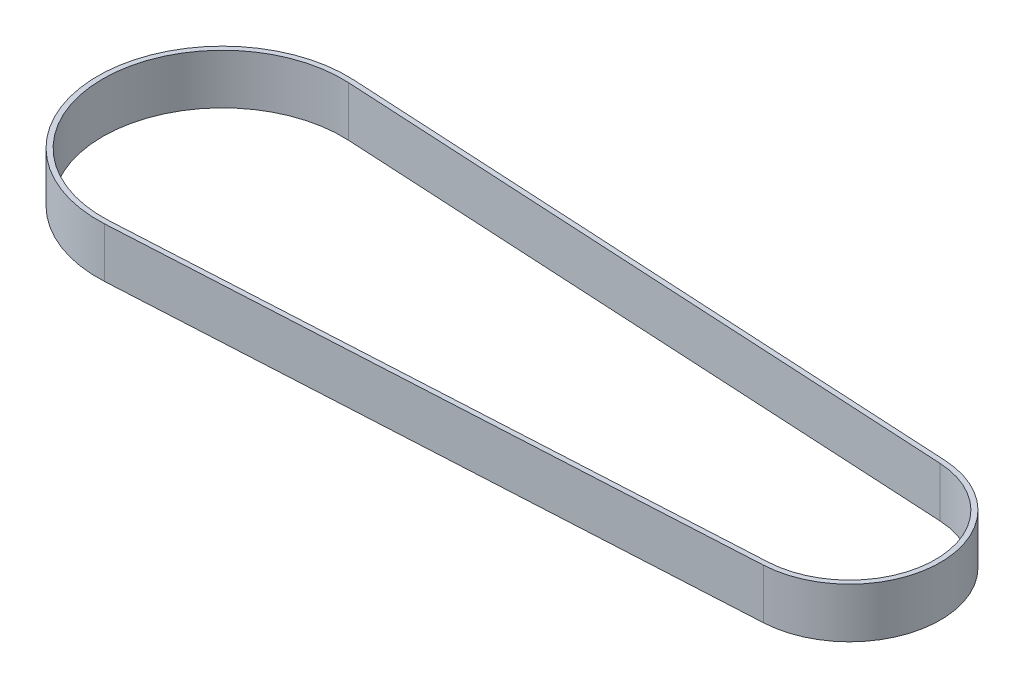
ISO-10303-21;
HEADER;
FILE_DESCRIPTION(('STEP AP214'),'2;1');
FILE_NAME('part.step','',(''),(''),'','','');
FILE_SCHEMA(('AUTOMOTIVE_DESIGN { 1 0 10303 214 1 1 1 1 }'));
ENDSEC;
DATA;
#1=APPLICATION_CONTEXT('core data for automotive mechanical design processes');
#2=APPLICATION_PROTOCOL_DEFINITION('international standard','automotive_design',2000,#1);
#3=PRODUCT_CONTEXT('',#1,'mechanical');
#4=PRODUCT('Part','Part','',(#3));
#5=PRODUCT_RELATED_PRODUCT_CATEGORY('part','',(#4));
#6=PRODUCT_DEFINITION_FORMATION('','',#4);
#7=PRODUCT_DEFINITION_CONTEXT('part definition',#1,'design');
#8=PRODUCT_DEFINITION('design','',#6,#7);
#9=PRODUCT_DEFINITION_SHAPE('','',#8);
#10=(LENGTH_UNIT() NAMED_UNIT(*) SI_UNIT(.MILLI.,.METRE.));
#11=(NAMED_UNIT(*) PLANE_ANGLE_UNIT() SI_UNIT($,.RADIAN.));
#12=(NAMED_UNIT(*) SI_UNIT($,.STERADIAN.) SOLID_ANGLE_UNIT());
#13=UNCERTAINTY_MEASURE_WITH_UNIT(LENGTH_MEASURE(1.E-05),#10,'distance_accuracy_value','');
#14=(GEOMETRIC_REPRESENTATION_CONTEXT(3) GLOBAL_UNCERTAINTY_ASSIGNED_CONTEXT((#13)) GLOBAL_UNIT_ASSIGNED_CONTEXT((#10,
#11,#12)) REPRESENTATION_CONTEXT('',''));
#15=CARTESIAN_POINT('',(0.,0.,0.));
#16=DIRECTION('',(0.,0.,1.));
#17=DIRECTION('',(1.,0.,0.));
#18=AXIS2_PLACEMENT_3D('',#15,#16,#17);
#19=CARTESIAN_POINT('',(0.,10.,0.));
#20=DIRECTION('',(0.,1.,0.));
#21=DIRECTION('',(0.,0.,1.));
#22=AXIS2_PLACEMENT_3D('',#19,#20,#21);
#23=PLANE('',#22);
#24=CARTESIAN_POINT('',(0.,10.,0.));
#25=DIRECTION('',(0.,1.,0.));
#26=DIRECTION('',(0.,0.,1.));
#27=AXIS2_PLACEMENT_3D('',#24,#25,#26);
#28=CIRCLE('',#27,25.);
#29=CARTESIAN_POINT('',(1.35350318471338,10.,-24.9633336942198));
#30=VERTEX_POINT('',#29);
#31=CARTESIAN_POINT('',(1.35350318471338,10.,24.9633336942198));
#32=VERTEX_POINT('',#31);
#33=EDGE_CURVE('E135',#30,#32,#28,.T.);
#34=ORIENTED_EDGE('',*,*,#33,.T.);
#35=DIRECTION('',(0.998533347768793,0.,-0.054140127388535));
#36=VECTOR('',#35,1.);
#37=CARTESIAN_POINT('',(1.35350318471338,10.,24.9633336942198));
#38=LINE('',#37,#36);
#39=CARTESIAN_POINT('',(126.585350318471,10.,18.173306929392));
#40=VERTEX_POINT('',#39);
#41=EDGE_CURVE('E138',#32,#40,#38,.T.);
#42=ORIENTED_EDGE('',*,*,#41,.T.);
#43=CARTESIAN_POINT('',(125.6,10.,0.));
#44=DIRECTION('',(0.,1.,0.));
#45=DIRECTION('',(0.,0.,1.));
#46=AXIS2_PLACEMENT_3D('',#43,#44,#45);
#47=CIRCLE('',#46,18.2);
#48=CARTESIAN_POINT('',(126.585350318471,10.,-18.173306929392));
#49=VERTEX_POINT('',#48);
#50=EDGE_CURVE('E141',#40,#49,#47,.T.);
#51=ORIENTED_EDGE('',*,*,#50,.T.);
#52=DIRECTION('',(-0.998533347768793,0.,-0.054140127388535));
#53=VECTOR('',#52,1.);
#54=CARTESIAN_POINT('',(1.35350318471338,10.,-24.9633336942198));
#55=LINE('',#54,#53);
#56=EDGE_CURVE('E143',#49,#30,#55,.T.);
#57=ORIENTED_EDGE('',*,*,#56,.T.);
#58=EDGE_LOOP('',(#34,#42,#51,#57));
#59=FACE_BOUND('',#58,.T.);
#60=DIRECTION('',(0.998533347768793,0.,-0.054140127388535));
#61=VECTOR('',#60,1.);
#62=CARTESIAN_POINT('',(1.29936305732484,10.,23.964800346451));
#63=LINE('',#62,#61);
#64=CARTESIAN_POINT('',(1.29936305732484,10.,23.964800346451));
#65=VERTEX_POINT('',#64);
#66=CARTESIAN_POINT('',(126.531210191083,10.,17.1747735816232));
#67=VERTEX_POINT('',#66);
#68=EDGE_CURVE('E107',#65,#67,#63,.T.);
#69=ORIENTED_EDGE('',*,*,#68,.F.);
#70=CARTESIAN_POINT('',(0.,10.,0.));
#71=DIRECTION('',(0.,1.,0.));
#72=DIRECTION('',(0.,0.,1.));
#73=AXIS2_PLACEMENT_3D('',#70,#71,#72);
#74=CIRCLE('',#73,24.);
#75=CARTESIAN_POINT('',(1.29936305732484,10.,-23.964800346451));
#76=VERTEX_POINT('',#75);
#77=EDGE_CURVE('E99',#76,#65,#74,.T.);
#78=ORIENTED_EDGE('',*,*,#77,.F.);
#79=DIRECTION('',(-0.998533347768793,0.,-0.054140127388535));
#80=VECTOR('',#79,1.);
#81=CARTESIAN_POINT('',(1.29936305732484,10.,-23.964800346451));
#82=LINE('',#81,#80);
#83=CARTESIAN_POINT('',(126.531210191083,10.,-17.1747735816232));
#84=VERTEX_POINT('',#83);
#85=EDGE_CURVE('E121',#84,#76,#82,.T.);
#86=ORIENTED_EDGE('',*,*,#85,.F.);
#87=CARTESIAN_POINT('',(125.6,10.,0.));
#88=DIRECTION('',(0.,1.,0.));
#89=DIRECTION('',(0.,0.,1.));
#90=AXIS2_PLACEMENT_3D('',#87,#88,#89);
#91=CIRCLE('',#90,17.2);
#92=EDGE_CURVE('E119',#67,#84,#91,.T.);
#93=ORIENTED_EDGE('',*,*,#92,.F.);
#94=EDGE_LOOP('',(#69,#78,#86,#93));
#95=FACE_BOUND('',#94,.T.);
#96=ADVANCED_FACE('F34',(#59,#95),#23,.T.);
#97=CARTESIAN_POINT('',(0.,0.,0.));
#98=DIRECTION('',(0.,1.,0.));
#99=DIRECTION('',(0.,0.,1.));
#100=AXIS2_PLACEMENT_3D('',#97,#98,#99);
#101=PLANE('',#100);
#102=CARTESIAN_POINT('',(0.,0.,0.));
#103=DIRECTION('',(0.,1.,0.));
#104=DIRECTION('',(0.,0.,1.));
#105=AXIS2_PLACEMENT_3D('',#102,#103,#104);
#106=CIRCLE('',#105,25.);
#107=CARTESIAN_POINT('',(1.35350318471338,0.,-24.9633336942198));
#108=VERTEX_POINT('',#107);
#109=CARTESIAN_POINT('',(1.35350318471338,0.,24.9633336942198));
#110=VERTEX_POINT('',#109);
#111=EDGE_CURVE('E115',#108,#110,#106,.T.);
#112=ORIENTED_EDGE('',*,*,#111,.F.);
#113=DIRECTION('',(-0.998533347768793,0.,-0.054140127388535));
#114=VECTOR('',#113,1.);
#115=CARTESIAN_POINT('',(1.35350318471338,0.,-24.9633336942198));
#116=LINE('',#115,#114);
#117=CARTESIAN_POINT('',(126.585350318471,0.,-18.173306929392));
#118=VERTEX_POINT('',#117);
#119=EDGE_CURVE('E139',#118,#108,#116,.T.);
#120=ORIENTED_EDGE('',*,*,#119,.F.);
#121=CARTESIAN_POINT('',(125.6,0.,0.));
#122=DIRECTION('',(0.,1.,0.));
#123=DIRECTION('',(0.,0.,1.));
#124=AXIS2_PLACEMENT_3D('',#121,#122,#123);
#125=CIRCLE('',#124,18.2);
#126=CARTESIAN_POINT('',(126.585350318471,0.,18.173306929392));
#127=VERTEX_POINT('',#126);
#128=EDGE_CURVE('E150',#127,#118,#125,.T.);
#129=ORIENTED_EDGE('',*,*,#128,.F.);
#130=DIRECTION('',(0.998533347768793,0.,-0.054140127388535));
#131=VECTOR('',#130,1.);
#132=CARTESIAN_POINT('',(1.35350318471338,0.,24.9633336942198));
#133=LINE('',#132,#131);
#134=EDGE_CURVE('E148',#110,#127,#133,.T.);
#135=ORIENTED_EDGE('',*,*,#134,.F.);
#136=EDGE_LOOP('',(#112,#120,#129,#135));
#137=FACE_BOUND('',#136,.T.);
#138=CARTESIAN_POINT('',(0.,0.,0.));
#139=DIRECTION('',(0.,1.,0.));
#140=DIRECTION('',(0.,0.,1.));
#141=AXIS2_PLACEMENT_3D('',#138,#139,#140);
#142=CIRCLE('',#141,24.);
#143=CARTESIAN_POINT('',(1.29936305732484,0.,-23.964800346451));
#144=VERTEX_POINT('',#143);
#145=CARTESIAN_POINT('',(1.29936305732484,0.,23.964800346451));
#146=VERTEX_POINT('',#145);
#147=EDGE_CURVE('E57',#144,#146,#142,.T.);
#148=ORIENTED_EDGE('',*,*,#147,.T.);
#149=DIRECTION('',(0.998533347768793,0.,-0.054140127388535));
#150=VECTOR('',#149,1.);
#151=CARTESIAN_POINT('',(1.29936305732484,0.,23.964800346451));
#152=LINE('',#151,#150);
#153=CARTESIAN_POINT('',(126.531210191083,0.,17.1747735816232));
#154=VERTEX_POINT('',#153);
#155=EDGE_CURVE('E114',#146,#154,#152,.T.);
#156=ORIENTED_EDGE('',*,*,#155,.T.);
#157=CARTESIAN_POINT('',(125.6,0.,0.));
#158=DIRECTION('',(0.,1.,0.));
#159=DIRECTION('',(0.,0.,1.));
#160=AXIS2_PLACEMENT_3D('',#157,#158,#159);
#161=CIRCLE('',#160,17.2);
#162=CARTESIAN_POINT('',(126.531210191083,0.,-17.1747735816232));
#163=VERTEX_POINT('',#162);
#164=EDGE_CURVE('E127',#154,#163,#161,.T.);
#165=ORIENTED_EDGE('',*,*,#164,.T.);
#166=DIRECTION('',(-0.998533347768793,0.,-0.054140127388535));
#167=VECTOR('',#166,1.);
#168=CARTESIAN_POINT('',(1.29936305732484,0.,-23.964800346451));
#169=LINE('',#168,#167);
#170=EDGE_CURVE('E108',#163,#144,#169,.T.);
#171=ORIENTED_EDGE('',*,*,#170,.T.);
#172=EDGE_LOOP('',(#148,#156,#165,#171));
#173=FACE_BOUND('',#172,.T.);
#174=ADVANCED_FACE('F168',(#137,#173),#101,.F.);
#175=CARTESIAN_POINT('',(0.,10.,0.));
#176=DIRECTION('',(0.,-1.,0.));
#177=DIRECTION('',(0.,0.,-1.));
#178=AXIS2_PLACEMENT_3D('',#175,#176,#177);
#179=CYLINDRICAL_SURFACE('',#178,25.);
#180=ORIENTED_EDGE('',*,*,#111,.T.);
#181=DIRECTION('',(0.,-1.,0.));
#182=VECTOR('',#181,1.);
#183=CARTESIAN_POINT('',(1.35350318471338,10.,24.9633336942198));
#184=LINE('',#183,#182);
#185=EDGE_CURVE('E11',#32,#110,#184,.T.);
#186=ORIENTED_EDGE('',*,*,#185,.F.);
#187=ORIENTED_EDGE('',*,*,#33,.F.);
#188=DIRECTION('',(0.,-1.,0.));
#189=VECTOR('',#188,1.);
#190=CARTESIAN_POINT('',(1.35350318471338,10.,-24.9633336942198));
#191=LINE('',#190,#189);
#192=EDGE_CURVE('E145',#30,#108,#191,.T.);
#193=ORIENTED_EDGE('',*,*,#192,.T.);
#194=EDGE_LOOP('',(#180,#186,#187,#193));
#195=FACE_BOUND('',#194,.T.);
#196=ADVANCED_FACE('F36',(#195),#179,.T.);
#197=CARTESIAN_POINT('',(1.35350318471338,10.,24.9633336942198));
#198=DIRECTION('',(-0.0541401273885351,0.,-0.998533347768793));
#199=DIRECTION('',(-0.998533347768793,0.,0.0541401273885351));
#200=AXIS2_PLACEMENT_3D('',#197,#198,#199);
#201=PLANE('',#200);
#202=ORIENTED_EDGE('',*,*,#134,.T.);
#203=DIRECTION('',(0.,-1.,0.));
#204=VECTOR('',#203,1.);
#205=CARTESIAN_POINT('',(126.585350318471,10.,18.173306929392));
#206=LINE('',#205,#204);
#207=EDGE_CURVE('E42',#40,#127,#206,.T.);
#208=ORIENTED_EDGE('',*,*,#207,.F.);
#209=ORIENTED_EDGE('',*,*,#41,.F.);
#210=ORIENTED_EDGE('',*,*,#185,.T.);
#211=EDGE_LOOP('',(#202,#208,#209,#210));
#212=FACE_BOUND('',#211,.T.);
#213=ADVANCED_FACE('F178',(#212),#201,.F.);
#214=CARTESIAN_POINT('',(125.6,10.,0.));
#215=DIRECTION('',(0.,-1.,0.));
#216=DIRECTION('',(0.,0.,-1.));
#217=AXIS2_PLACEMENT_3D('',#214,#215,#216);
#218=CYLINDRICAL_SURFACE('',#217,18.2);
#219=ORIENTED_EDGE('',*,*,#128,.T.);
#220=DIRECTION('',(0.,-1.,0.));
#221=VECTOR('',#220,1.);
#222=CARTESIAN_POINT('',(126.585350318471,10.,-18.173306929392));
#223=LINE('',#222,#221);
#224=EDGE_CURVE('E155',#49,#118,#223,.T.);
#225=ORIENTED_EDGE('',*,*,#224,.F.);
#226=ORIENTED_EDGE('',*,*,#50,.F.);
#227=ORIENTED_EDGE('',*,*,#207,.T.);
#228=EDGE_LOOP('',(#219,#225,#226,#227));
#229=FACE_BOUND('',#228,.T.);
#230=ADVANCED_FACE('F162',(#229),#218,.T.);
#231=CARTESIAN_POINT('',(1.35350318471338,10.,-24.9633336942198));
#232=DIRECTION('',(-0.0541401273885351,0.,0.998533347768793));
#233=DIRECTION('',(0.998533347768793,0.,0.0541401273885351));
#234=AXIS2_PLACEMENT_3D('',#231,#232,#233);
#235=PLANE('',#234);
#236=ORIENTED_EDGE('',*,*,#119,.T.);
#237=ORIENTED_EDGE('',*,*,#192,.F.);
#238=ORIENTED_EDGE('',*,*,#56,.F.);
#239=ORIENTED_EDGE('',*,*,#224,.T.);
#240=EDGE_LOOP('',(#236,#237,#238,#239));
#241=FACE_BOUND('',#240,.T.);
#242=ADVANCED_FACE('F172',(#241),#235,.F.);
#243=CARTESIAN_POINT('',(0.,10.,0.));
#244=DIRECTION('',(0.,-1.,0.));
#245=DIRECTION('',(0.,0.,-1.));
#246=AXIS2_PLACEMENT_3D('',#243,#244,#245);
#247=CYLINDRICAL_SURFACE('',#246,24.);
#248=ORIENTED_EDGE('',*,*,#147,.F.);
#249=DIRECTION('',(0.,-1.,0.));
#250=VECTOR('',#249,1.);
#251=CARTESIAN_POINT('',(1.29936305732484,10.,-23.964800346451));
#252=LINE('',#251,#250);
#253=EDGE_CURVE('E103',#76,#144,#252,.T.);
#254=ORIENTED_EDGE('',*,*,#253,.F.);
#255=ORIENTED_EDGE('',*,*,#77,.T.);
#256=DIRECTION('',(0.,-1.,0.));
#257=VECTOR('',#256,1.);
#258=CARTESIAN_POINT('',(1.29936305732484,10.,23.964800346451));
#259=LINE('',#258,#257);
#260=EDGE_CURVE('E102',#65,#146,#259,.T.);
#261=ORIENTED_EDGE('',*,*,#260,.T.);
#262=EDGE_LOOP('',(#248,#254,#255,#261));
#263=FACE_BOUND('',#262,.T.);
#264=ADVANCED_FACE('F101',(#263),#247,.F.);
#265=CARTESIAN_POINT('',(1.29936305732484,10.,23.964800346451));
#266=DIRECTION('',(-0.054140127388535,0.,-0.998533347768793));
#267=DIRECTION('',(-0.998533347768793,0.,0.054140127388535));
#268=AXIS2_PLACEMENT_3D('',#265,#266,#267);
#269=PLANE('',#268);
#270=ORIENTED_EDGE('',*,*,#155,.F.);
#271=ORIENTED_EDGE('',*,*,#260,.F.);
#272=ORIENTED_EDGE('',*,*,#68,.T.);
#273=DIRECTION('',(0.,-1.,0.));
#274=VECTOR('',#273,1.);
#275=CARTESIAN_POINT('',(126.531210191083,10.,17.1747735816232));
#276=LINE('',#275,#274);
#277=EDGE_CURVE('E116',#67,#154,#276,.T.);
#278=ORIENTED_EDGE('',*,*,#277,.T.);
#279=EDGE_LOOP('',(#270,#271,#272,#278));
#280=FACE_BOUND('',#279,.T.);
#281=ADVANCED_FACE('F111',(#280),#269,.T.);
#282=CARTESIAN_POINT('',(125.6,10.,0.));
#283=DIRECTION('',(0.,-1.,0.));
#284=DIRECTION('',(0.,0.,-1.));
#285=AXIS2_PLACEMENT_3D('',#282,#283,#284);
#286=CYLINDRICAL_SURFACE('',#285,17.2);
#287=ORIENTED_EDGE('',*,*,#164,.F.);
#288=ORIENTED_EDGE('',*,*,#277,.F.);
#289=ORIENTED_EDGE('',*,*,#92,.T.);
#290=DIRECTION('',(0.,-1.,0.));
#291=VECTOR('',#290,1.);
#292=CARTESIAN_POINT('',(126.531210191083,10.,-17.1747735816232));
#293=LINE('',#292,#291);
#294=EDGE_CURVE('E49',#84,#163,#293,.T.);
#295=ORIENTED_EDGE('',*,*,#294,.T.);
#296=EDGE_LOOP('',(#287,#288,#289,#295));
#297=FACE_BOUND('',#296,.T.);
#298=ADVANCED_FACE('F201',(#297),#286,.F.);
#299=CARTESIAN_POINT('',(1.29936305732484,10.,-23.964800346451));
#300=DIRECTION('',(-0.054140127388535,0.,0.998533347768793));
#301=DIRECTION('',(0.998533347768793,0.,0.054140127388535));
#302=AXIS2_PLACEMENT_3D('',#299,#300,#301);
#303=PLANE('',#302);
#304=ORIENTED_EDGE('',*,*,#170,.F.);
#305=ORIENTED_EDGE('',*,*,#294,.F.);
#306=ORIENTED_EDGE('',*,*,#85,.T.);
#307=ORIENTED_EDGE('',*,*,#253,.T.);
#308=EDGE_LOOP('',(#304,#305,#306,#307));
#309=FACE_BOUND('',#308,.T.);
#310=ADVANCED_FACE('F205',(#309),#303,.T.);
#311=CLOSED_SHELL('',(#96,#174,#196,#213,#230,#242,#264,#281,#298,#310));
#312=MANIFOLD_SOLID_BREP('B2',#311);
#313=ADVANCED_BREP_SHAPE_REPRESENTATION('',(#18,#312),#14);
#314=SHAPE_DEFINITION_REPRESENTATION(#9,#313);
ENDSEC;
END-ISO-10303-21;
